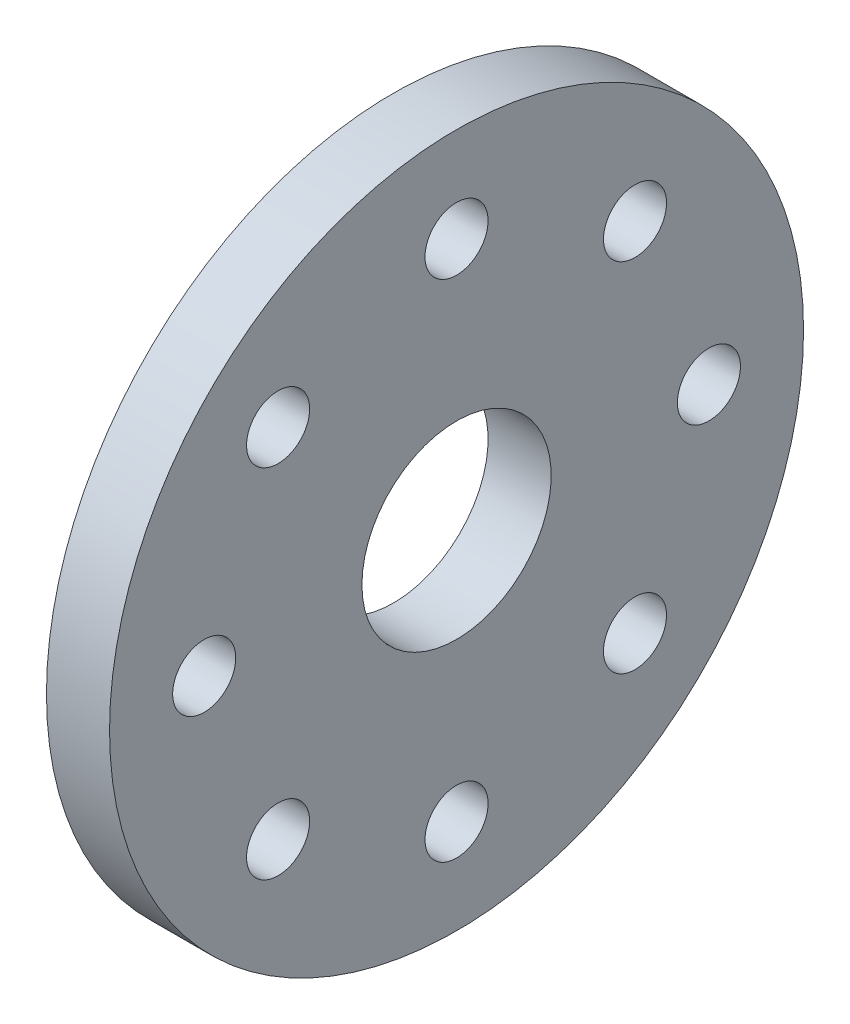
ISO-10303-21;
HEADER;
FILE_DESCRIPTION(('STEP AP214'),'2;1');
FILE_NAME('part.step','',(''),(''),'','','');
FILE_SCHEMA(('AUTOMOTIVE_DESIGN { 1 0 10303 214 1 1 1 1 }'));
ENDSEC;
DATA;
#1=APPLICATION_CONTEXT('core data for automotive mechanical design processes');
#2=APPLICATION_PROTOCOL_DEFINITION('international standard','automotive_design',2000,#1);
#3=PRODUCT_CONTEXT('',#1,'mechanical');
#4=PRODUCT('Part','Part','',(#3));
#5=PRODUCT_RELATED_PRODUCT_CATEGORY('part','',(#4));
#6=PRODUCT_DEFINITION_FORMATION('','',#4);
#7=PRODUCT_DEFINITION_CONTEXT('part definition',#1,'design');
#8=PRODUCT_DEFINITION('design','',#6,#7);
#9=PRODUCT_DEFINITION_SHAPE('','',#8);
#10=(LENGTH_UNIT() NAMED_UNIT(*) SI_UNIT(.MILLI.,.METRE.));
#11=(NAMED_UNIT(*) PLANE_ANGLE_UNIT() SI_UNIT($,.RADIAN.));
#12=(NAMED_UNIT(*) SI_UNIT($,.STERADIAN.) SOLID_ANGLE_UNIT());
#13=UNCERTAINTY_MEASURE_WITH_UNIT(LENGTH_MEASURE(1.E-05),#10,'distance_accuracy_value','');
#14=(GEOMETRIC_REPRESENTATION_CONTEXT(3) GLOBAL_UNCERTAINTY_ASSIGNED_CONTEXT((#13)) GLOBAL_UNIT_ASSIGNED_CONTEXT((#10,
#11,#12)) REPRESENTATION_CONTEXT('',''));
#15=CARTESIAN_POINT('',(0.,0.,0.));
#16=DIRECTION('',(0.,0.,1.));
#17=DIRECTION('',(1.,0.,0.));
#18=AXIS2_PLACEMENT_3D('',#15,#16,#17);
#19=CARTESIAN_POINT('',(0.,0.,0.));
#20=DIRECTION('',(-1.,0.,0.));
#21=DIRECTION('',(0.,0.,1.));
#22=AXIS2_PLACEMENT_3D('',#19,#20,#21);
#23=CYLINDRICAL_SURFACE('',#22,3.);
#24=CARTESIAN_POINT('',(1.,0.,0.));
#25=DIRECTION('',(-1.,0.,0.));
#26=DIRECTION('',(0.,0.,1.));
#27=AXIS2_PLACEMENT_3D('',#24,#25,#26);
#28=CIRCLE('',#27,3.);
#29=CARTESIAN_POINT('',(1.,0.,3.));
#30=VERTEX_POINT('',#29);
#31=EDGE_CURVE('E28',#30,#30,#28,.T.);
#32=ORIENTED_EDGE('',*,*,#31,.F.);
#33=EDGE_LOOP('',(#32));
#34=FACE_BOUND('',#33,.T.);
#35=CARTESIAN_POINT('',(-1.,0.,0.));
#36=DIRECTION('',(-1.,0.,0.));
#37=DIRECTION('',(0.,0.,1.));
#38=AXIS2_PLACEMENT_3D('',#35,#36,#37);
#39=CIRCLE('',#38,3.);
#40=CARTESIAN_POINT('',(-1.,0.,3.));
#41=VERTEX_POINT('',#40);
#42=EDGE_CURVE('E10',#41,#41,#39,.T.);
#43=ORIENTED_EDGE('',*,*,#42,.T.);
#44=EDGE_LOOP('',(#43));
#45=FACE_BOUND('',#44,.T.);
#46=ADVANCED_FACE('F14',(#34,#45),#23,.F.);
#47=CARTESIAN_POINT('',(-1.,3.,0.));
#48=DIRECTION('',(1.,0.,0.));
#49=DIRECTION('',(0.,0.,-1.));
#50=AXIS2_PLACEMENT_3D('',#47,#48,#49);
#51=PLANE('',#50);
#52=CARTESIAN_POINT('',(-1.,5.65685424949245,5.65685424949231));
#53=DIRECTION('',(-1.,0.,0.));
#54=DIRECTION('',(0.,-0.707106781186539,0.707106781186556));
#55=AXIS2_PLACEMENT_3D('',#52,#53,#54);
#56=CIRCLE('',#55,1.);
#57=CARTESIAN_POINT('',(-1.,4.94974746830591,6.36396103067887));
#58=VERTEX_POINT('',#57);
#59=EDGE_CURVE('E76',#58,#58,#56,.T.);
#60=ORIENTED_EDGE('',*,*,#59,.F.);
#61=EDGE_LOOP('',(#60));
#62=FACE_BOUND('',#61,.T.);
#63=CARTESIAN_POINT('',(-1.,0.,8.));
#64=DIRECTION('',(-1.,0.,0.));
#65=DIRECTION('',(0.,-1.,0.));
#66=AXIS2_PLACEMENT_3D('',#63,#64,#65);
#67=CIRCLE('',#66,1.);
#68=CARTESIAN_POINT('',(-1.,-0.999999999999916,8.00000000000001));
#69=VERTEX_POINT('',#68);
#70=EDGE_CURVE('E70',#69,#69,#67,.T.);
#71=ORIENTED_EDGE('',*,*,#70,.F.);
#72=EDGE_LOOP('',(#71));
#73=FACE_BOUND('',#72,.T.);
#74=CARTESIAN_POINT('',(-1.,-5.65685424949233,5.65685424949243));
#75=DIRECTION('',(-1.,0.,0.));
#76=DIRECTION('',(0.,-0.707106781186554,-0.707106781186541));
#77=AXIS2_PLACEMENT_3D('',#74,#75,#76);
#78=CIRCLE('',#77,1.);
#79=CARTESIAN_POINT('',(-1.,-6.36396103067888,4.94974746830589));
#80=VERTEX_POINT('',#79);
#81=EDGE_CURVE('E64',#80,#80,#78,.T.);
#82=ORIENTED_EDGE('',*,*,#81,.F.);
#83=EDGE_LOOP('',(#82));
#84=FACE_BOUND('',#83,.T.);
#85=CARTESIAN_POINT('',(-1.,-8.,0.));
#86=DIRECTION('',(-1.,0.,0.));
#87=DIRECTION('',(0.,0.,-1.));
#88=AXIS2_PLACEMENT_3D('',#85,#86,#87);
#89=CIRCLE('',#88,1.);
#90=CARTESIAN_POINT('',(-1.,-8.,-1.));
#91=VERTEX_POINT('',#90);
#92=EDGE_CURVE('E58',#91,#91,#89,.T.);
#93=ORIENTED_EDGE('',*,*,#92,.F.);
#94=EDGE_LOOP('',(#93));
#95=FACE_BOUND('',#94,.T.);
#96=CARTESIAN_POINT('',(-1.,-5.65685424949241,-5.65685424949235));
#97=DIRECTION('',(-1.,0.,0.));
#98=DIRECTION('',(0.,0.707106781186544,-0.707106781186551));
#99=AXIS2_PLACEMENT_3D('',#96,#97,#98);
#100=CIRCLE('',#99,1.);
#101=CARTESIAN_POINT('',(-1.,-4.94974746830587,-6.3639610306789));
#102=VERTEX_POINT('',#101);
#103=EDGE_CURVE('E52',#102,#102,#100,.T.);
#104=ORIENTED_EDGE('',*,*,#103,.F.);
#105=EDGE_LOOP('',(#104));
#106=FACE_BOUND('',#105,.T.);
#107=CARTESIAN_POINT('',(-1.,0.,-8.));
#108=DIRECTION('',(-1.,0.,0.));
#109=DIRECTION('',(0.,1.,0.));
#110=AXIS2_PLACEMENT_3D('',#107,#108,#109);
#111=CIRCLE('',#110,1.);
#112=CARTESIAN_POINT('',(-1.,0.999999999999972,-8.));
#113=VERTEX_POINT('',#112);
#114=EDGE_CURVE('E46',#113,#113,#111,.T.);
#115=ORIENTED_EDGE('',*,*,#114,.F.);
#116=EDGE_LOOP('',(#115));
#117=FACE_BOUND('',#116,.T.);
#118=CARTESIAN_POINT('',(-1.,5.65685424949237,-5.65685424949239));
#119=DIRECTION('',(-1.,0.,0.));
#120=DIRECTION('',(0.,0.707106781186549,0.707106781186546));
#121=AXIS2_PLACEMENT_3D('',#118,#119,#120);
#122=CIRCLE('',#121,1.);
#123=CARTESIAN_POINT('',(-1.,6.36396103067892,-4.94974746830584));
#124=VERTEX_POINT('',#123);
#125=EDGE_CURVE('E40',#124,#124,#122,.T.);
#126=ORIENTED_EDGE('',*,*,#125,.F.);
#127=EDGE_LOOP('',(#126));
#128=FACE_BOUND('',#127,.T.);
#129=CARTESIAN_POINT('',(-1.,8.,0.));
#130=DIRECTION('',(-1.,0.,0.));
#131=DIRECTION('',(0.,0.,1.));
#132=AXIS2_PLACEMENT_3D('',#129,#130,#131);
#133=CIRCLE('',#132,1.);
#134=CARTESIAN_POINT('',(-1.,8.,1.));
#135=VERTEX_POINT('',#134);
#136=EDGE_CURVE('E34',#135,#135,#133,.T.);
#137=ORIENTED_EDGE('',*,*,#136,.F.);
#138=EDGE_LOOP('',(#137));
#139=FACE_BOUND('',#138,.T.);
#140=ORIENTED_EDGE('',*,*,#42,.F.);
#141=EDGE_LOOP('',(#140));
#142=FACE_BOUND('',#141,.T.);
#143=CARTESIAN_POINT('',(-1.,0.,0.));
#144=DIRECTION('',(-1.,0.,0.));
#145=DIRECTION('',(0.,0.,1.));
#146=AXIS2_PLACEMENT_3D('',#143,#144,#145);
#147=CIRCLE('',#146,11.);
#148=CARTESIAN_POINT('',(-1.,0.,11.));
#149=VERTEX_POINT('',#148);
#150=EDGE_CURVE('E20',#149,#149,#147,.T.);
#151=ORIENTED_EDGE('',*,*,#150,.T.);
#152=EDGE_LOOP('',(#151));
#153=FACE_BOUND('',#152,.T.);
#154=ADVANCED_FACE('F92',(#62,#73,#84,#95,#106,#117,#128,#139,#142,#153),#51,.F.);
#155=CARTESIAN_POINT('',(0.,0.,0.));
#156=DIRECTION('',(-1.,0.,0.));
#157=DIRECTION('',(0.,0.,1.));
#158=AXIS2_PLACEMENT_3D('',#155,#156,#157);
#159=CYLINDRICAL_SURFACE('',#158,11.);
#160=ORIENTED_EDGE('',*,*,#150,.F.);
#161=EDGE_LOOP('',(#160));
#162=FACE_BOUND('',#161,.T.);
#163=CARTESIAN_POINT('',(1.,0.,0.));
#164=DIRECTION('',(-1.,0.,0.));
#165=DIRECTION('',(0.,0.,1.));
#166=AXIS2_PLACEMENT_3D('',#163,#164,#165);
#167=CIRCLE('',#166,11.);
#168=CARTESIAN_POINT('',(1.,0.,11.));
#169=VERTEX_POINT('',#168);
#170=EDGE_CURVE('E24',#169,#169,#167,.T.);
#171=ORIENTED_EDGE('',*,*,#170,.T.);
#172=EDGE_LOOP('',(#171));
#173=FACE_BOUND('',#172,.T.);
#174=ADVANCED_FACE('F95',(#162,#173),#159,.T.);
#175=CARTESIAN_POINT('',(1.,11.,0.));
#176=DIRECTION('',(-1.,0.,0.));
#177=DIRECTION('',(0.,0.,1.));
#178=AXIS2_PLACEMENT_3D('',#175,#176,#177);
#179=PLANE('',#178);
#180=CARTESIAN_POINT('',(1.,5.65685424949245,5.65685424949231));
#181=DIRECTION('',(-1.,0.,0.));
#182=DIRECTION('',(0.,-0.707106781186539,0.707106781186556));
#183=AXIS2_PLACEMENT_3D('',#180,#181,#182);
#184=CIRCLE('',#183,1.);
#185=CARTESIAN_POINT('',(1.,4.94974746830591,6.36396103067887));
#186=VERTEX_POINT('',#185);
#187=EDGE_CURVE('E73',#186,#186,#184,.T.);
#188=ORIENTED_EDGE('',*,*,#187,.T.);
#189=EDGE_LOOP('',(#188));
#190=FACE_BOUND('',#189,.T.);
#191=CARTESIAN_POINT('',(1.,0.,8.));
#192=DIRECTION('',(-1.,0.,0.));
#193=DIRECTION('',(0.,-1.,0.));
#194=AXIS2_PLACEMENT_3D('',#191,#192,#193);
#195=CIRCLE('',#194,1.);
#196=CARTESIAN_POINT('',(1.,-0.999999999999916,8.00000000000001));
#197=VERTEX_POINT('',#196);
#198=EDGE_CURVE('E67',#197,#197,#195,.T.);
#199=ORIENTED_EDGE('',*,*,#198,.T.);
#200=EDGE_LOOP('',(#199));
#201=FACE_BOUND('',#200,.T.);
#202=CARTESIAN_POINT('',(1.,-5.65685424949233,5.65685424949243));
#203=DIRECTION('',(-1.,0.,0.));
#204=DIRECTION('',(0.,-0.707106781186554,-0.707106781186541));
#205=AXIS2_PLACEMENT_3D('',#202,#203,#204);
#206=CIRCLE('',#205,1.);
#207=CARTESIAN_POINT('',(1.,-6.36396103067888,4.94974746830589));
#208=VERTEX_POINT('',#207);
#209=EDGE_CURVE('E61',#208,#208,#206,.T.);
#210=ORIENTED_EDGE('',*,*,#209,.T.);
#211=EDGE_LOOP('',(#210));
#212=FACE_BOUND('',#211,.T.);
#213=CARTESIAN_POINT('',(1.,-8.,0.));
#214=DIRECTION('',(-1.,0.,0.));
#215=DIRECTION('',(0.,0.,-1.));
#216=AXIS2_PLACEMENT_3D('',#213,#214,#215);
#217=CIRCLE('',#216,1.);
#218=CARTESIAN_POINT('',(1.,-8.,-1.));
#219=VERTEX_POINT('',#218);
#220=EDGE_CURVE('E55',#219,#219,#217,.T.);
#221=ORIENTED_EDGE('',*,*,#220,.T.);
#222=EDGE_LOOP('',(#221));
#223=FACE_BOUND('',#222,.T.);
#224=CARTESIAN_POINT('',(1.,-5.65685424949241,-5.65685424949235));
#225=DIRECTION('',(-1.,0.,0.));
#226=DIRECTION('',(0.,0.707106781186544,-0.707106781186551));
#227=AXIS2_PLACEMENT_3D('',#224,#225,#226);
#228=CIRCLE('',#227,1.);
#229=CARTESIAN_POINT('',(1.,-4.94974746830587,-6.3639610306789));
#230=VERTEX_POINT('',#229);
#231=EDGE_CURVE('E49',#230,#230,#228,.T.);
#232=ORIENTED_EDGE('',*,*,#231,.T.);
#233=EDGE_LOOP('',(#232));
#234=FACE_BOUND('',#233,.T.);
#235=CARTESIAN_POINT('',(1.,0.,-8.));
#236=DIRECTION('',(-1.,0.,0.));
#237=DIRECTION('',(0.,1.,0.));
#238=AXIS2_PLACEMENT_3D('',#235,#236,#237);
#239=CIRCLE('',#238,1.);
#240=CARTESIAN_POINT('',(1.,0.999999999999972,-8.));
#241=VERTEX_POINT('',#240);
#242=EDGE_CURVE('E43',#241,#241,#239,.T.);
#243=ORIENTED_EDGE('',*,*,#242,.T.);
#244=EDGE_LOOP('',(#243));
#245=FACE_BOUND('',#244,.T.);
#246=CARTESIAN_POINT('',(1.,5.65685424949237,-5.65685424949239));
#247=DIRECTION('',(-1.,0.,0.));
#248=DIRECTION('',(0.,0.707106781186549,0.707106781186546));
#249=AXIS2_PLACEMENT_3D('',#246,#247,#248);
#250=CIRCLE('',#249,1.);
#251=CARTESIAN_POINT('',(1.,6.36396103067892,-4.94974746830584));
#252=VERTEX_POINT('',#251);
#253=EDGE_CURVE('E37',#252,#252,#250,.T.);
#254=ORIENTED_EDGE('',*,*,#253,.T.);
#255=EDGE_LOOP('',(#254));
#256=FACE_BOUND('',#255,.T.);
#257=CARTESIAN_POINT('',(1.,8.,0.));
#258=DIRECTION('',(-1.,0.,0.));
#259=DIRECTION('',(0.,0.,1.));
#260=AXIS2_PLACEMENT_3D('',#257,#258,#259);
#261=CIRCLE('',#260,1.);
#262=CARTESIAN_POINT('',(1.,8.,1.));
#263=VERTEX_POINT('',#262);
#264=EDGE_CURVE('E33',#263,#263,#261,.T.);
#265=ORIENTED_EDGE('',*,*,#264,.T.);
#266=EDGE_LOOP('',(#265));
#267=FACE_BOUND('',#266,.T.);
#268=ORIENTED_EDGE('',*,*,#170,.F.);
#269=EDGE_LOOP('',(#268));
#270=FACE_BOUND('',#269,.T.);
#271=ORIENTED_EDGE('',*,*,#31,.T.);
#272=EDGE_LOOP('',(#271));
#273=FACE_BOUND('',#272,.T.);
#274=ADVANCED_FACE('F82',(#190,#201,#212,#223,#234,#245,#256,#267,#270,#273),#179,.F.);
#275=CARTESIAN_POINT('',(1.,8.,0.));
#276=DIRECTION('',(-1.,0.,0.));
#277=DIRECTION('',(0.,0.,1.));
#278=AXIS2_PLACEMENT_3D('',#275,#276,#277);
#279=CYLINDRICAL_SURFACE('',#278,1.);
#280=ORIENTED_EDGE('',*,*,#264,.F.);
#281=EDGE_LOOP('',(#280));
#282=FACE_BOUND('',#281,.T.);
#283=ORIENTED_EDGE('',*,*,#136,.T.);
#284=EDGE_LOOP('',(#283));
#285=FACE_BOUND('',#284,.T.);
#286=ADVANCED_FACE('F111',(#282,#285),#279,.F.);
#287=CARTESIAN_POINT('',(1.,5.65685424949237,-5.65685424949239));
#288=DIRECTION('',(-1.,0.,0.));
#289=DIRECTION('',(0.,0.,1.));
#290=AXIS2_PLACEMENT_3D('',#287,#288,#289);
#291=CYLINDRICAL_SURFACE('',#290,1.);
#292=ORIENTED_EDGE('',*,*,#253,.F.);
#293=EDGE_LOOP('',(#292));
#294=FACE_BOUND('',#293,.T.);
#295=ORIENTED_EDGE('',*,*,#125,.T.);
#296=EDGE_LOOP('',(#295));
#297=FACE_BOUND('',#296,.T.);
#298=ADVANCED_FACE('F113',(#294,#297),#291,.F.);
#299=CARTESIAN_POINT('',(1.,0.,-8.));
#300=DIRECTION('',(-1.,0.,0.));
#301=DIRECTION('',(0.,0.,1.));
#302=AXIS2_PLACEMENT_3D('',#299,#300,#301);
#303=CYLINDRICAL_SURFACE('',#302,1.);
#304=ORIENTED_EDGE('',*,*,#242,.F.);
#305=EDGE_LOOP('',(#304));
#306=FACE_BOUND('',#305,.T.);
#307=ORIENTED_EDGE('',*,*,#114,.T.);
#308=EDGE_LOOP('',(#307));
#309=FACE_BOUND('',#308,.T.);
#310=ADVANCED_FACE('F122',(#306,#309),#303,.F.);
#311=CARTESIAN_POINT('',(1.,-5.65685424949241,-5.65685424949235));
#312=DIRECTION('',(-1.,0.,0.));
#313=DIRECTION('',(0.,0.,1.));
#314=AXIS2_PLACEMENT_3D('',#311,#312,#313);
#315=CYLINDRICAL_SURFACE('',#314,1.);
#316=ORIENTED_EDGE('',*,*,#231,.F.);
#317=EDGE_LOOP('',(#316));
#318=FACE_BOUND('',#317,.T.);
#319=ORIENTED_EDGE('',*,*,#103,.T.);
#320=EDGE_LOOP('',(#319));
#321=FACE_BOUND('',#320,.T.);
#322=ADVANCED_FACE('F178',(#318,#321),#315,.F.);
#323=CARTESIAN_POINT('',(1.,-8.,0.));
#324=DIRECTION('',(-1.,0.,0.));
#325=DIRECTION('',(0.,0.,1.));
#326=AXIS2_PLACEMENT_3D('',#323,#324,#325);
#327=CYLINDRICAL_SURFACE('',#326,1.);
#328=ORIENTED_EDGE('',*,*,#220,.F.);
#329=EDGE_LOOP('',(#328));
#330=FACE_BOUND('',#329,.T.);
#331=ORIENTED_EDGE('',*,*,#92,.T.);
#332=EDGE_LOOP('',(#331));
#333=FACE_BOUND('',#332,.T.);
#334=ADVANCED_FACE('F186',(#330,#333),#327,.F.);
#335=CARTESIAN_POINT('',(1.,-5.65685424949233,5.65685424949243));
#336=DIRECTION('',(-1.,0.,0.));
#337=DIRECTION('',(0.,0.,1.));
#338=AXIS2_PLACEMENT_3D('',#335,#336,#337);
#339=CYLINDRICAL_SURFACE('',#338,1.);
#340=ORIENTED_EDGE('',*,*,#209,.F.);
#341=EDGE_LOOP('',(#340));
#342=FACE_BOUND('',#341,.T.);
#343=ORIENTED_EDGE('',*,*,#81,.T.);
#344=EDGE_LOOP('',(#343));
#345=FACE_BOUND('',#344,.T.);
#346=ADVANCED_FACE('F195',(#342,#345),#339,.F.);
#347=CARTESIAN_POINT('',(1.,0.,8.));
#348=DIRECTION('',(-1.,0.,0.));
#349=DIRECTION('',(0.,0.,1.));
#350=AXIS2_PLACEMENT_3D('',#347,#348,#349);
#351=CYLINDRICAL_SURFACE('',#350,1.);
#352=ORIENTED_EDGE('',*,*,#198,.F.);
#353=EDGE_LOOP('',(#352));
#354=FACE_BOUND('',#353,.T.);
#355=ORIENTED_EDGE('',*,*,#70,.T.);
#356=EDGE_LOOP('',(#355));
#357=FACE_BOUND('',#356,.T.);
#358=ADVANCED_FACE('F88',(#354,#357),#351,.F.);
#359=CARTESIAN_POINT('',(1.,5.65685424949245,5.65685424949231));
#360=DIRECTION('',(-1.,0.,0.));
#361=DIRECTION('',(0.,0.,1.));
#362=AXIS2_PLACEMENT_3D('',#359,#360,#361);
#363=CYLINDRICAL_SURFACE('',#362,1.);
#364=ORIENTED_EDGE('',*,*,#187,.F.);
#365=EDGE_LOOP('',(#364));
#366=FACE_BOUND('',#365,.T.);
#367=ORIENTED_EDGE('',*,*,#59,.T.);
#368=EDGE_LOOP('',(#367));
#369=FACE_BOUND('',#368,.T.);
#370=ADVANCED_FACE('F85',(#366,#369),#363,.F.);
#371=CLOSED_SHELL('',(#46,#154,#174,#274,#286,#298,#310,#322,#334,#346,#358,#370));
#372=MANIFOLD_SOLID_BREP('B1',#371);
#373=ADVANCED_BREP_SHAPE_REPRESENTATION('',(#18,#372),#14);
#374=SHAPE_DEFINITION_REPRESENTATION(#9,#373);
ENDSEC;
END-ISO-10303-21;
